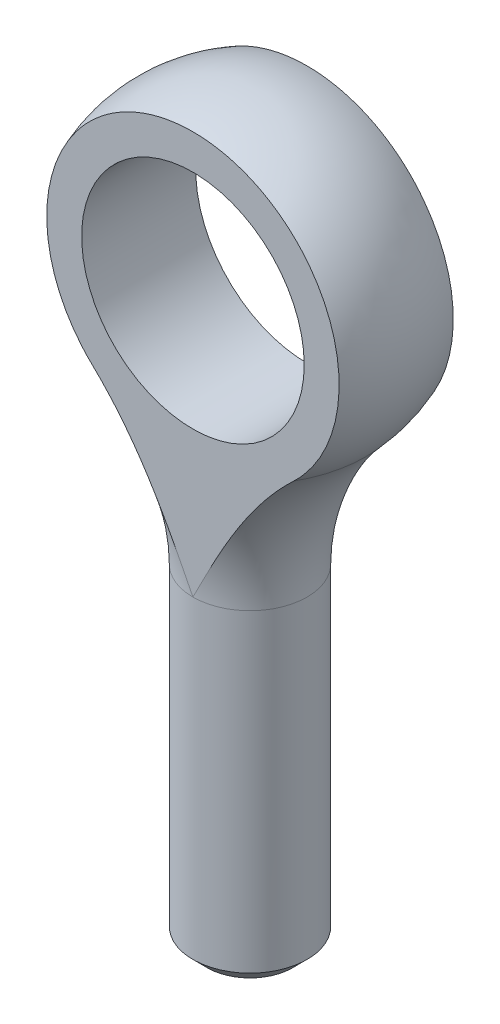
ISO-10303-21;
HEADER;
FILE_DESCRIPTION(('STEP AP214'),'2;1');
FILE_NAME('part.step','',(''),(''),'','','');
FILE_SCHEMA(('AUTOMOTIVE_DESIGN { 1 0 10303 214 1 1 1 1 }'));
ENDSEC;
DATA;
#1=APPLICATION_CONTEXT('core data for automotive mechanical design processes');
#2=APPLICATION_PROTOCOL_DEFINITION('international standard','automotive_design',2000,#1);
#3=PRODUCT_CONTEXT('',#1,'mechanical');
#4=PRODUCT('Part','Part','',(#3));
#5=PRODUCT_RELATED_PRODUCT_CATEGORY('part','',(#4));
#6=PRODUCT_DEFINITION_FORMATION('','',#4);
#7=PRODUCT_DEFINITION_CONTEXT('part definition',#1,'design');
#8=PRODUCT_DEFINITION('design','',#6,#7);
#9=PRODUCT_DEFINITION_SHAPE('','',#8);
#10=(LENGTH_UNIT() NAMED_UNIT(*) SI_UNIT(.MILLI.,.METRE.));
#11=(NAMED_UNIT(*) PLANE_ANGLE_UNIT() SI_UNIT($,.RADIAN.));
#12=(NAMED_UNIT(*) SI_UNIT($,.STERADIAN.) SOLID_ANGLE_UNIT());
#13=UNCERTAINTY_MEASURE_WITH_UNIT(LENGTH_MEASURE(1.E-05),#10,'distance_accuracy_value','');
#14=(GEOMETRIC_REPRESENTATION_CONTEXT(3) GLOBAL_UNCERTAINTY_ASSIGNED_CONTEXT((#13)) GLOBAL_UNIT_ASSIGNED_CONTEXT((#10,
#11,#12)) REPRESENTATION_CONTEXT('',''));
#15=CARTESIAN_POINT('',(0.,0.,0.));
#16=DIRECTION('',(0.,0.,1.));
#17=DIRECTION('',(1.,0.,0.));
#18=AXIS2_PLACEMENT_3D('',#15,#16,#17);
#19=CARTESIAN_POINT('',(0.,3.66738266034692,0.));
#20=DIRECTION('',(0.,-1.,0.));
#21=DIRECTION('',(1.,0.,0.));
#22=AXIS2_PLACEMENT_3D('',#19,#20,#21);
#23=TOROIDAL_SURFACE('',#22,15.5915178571429,12.4165178571429);
#24=CARTESIAN_POINT('',(0.,3.66738266034692,-3.17500000000003));
#25=CARTESIAN_POINT('',(-0.00237038639248425,3.67207024042008,-3.17500000000002));
#26=CARTESIAN_POINT('',(-0.0047407847306486,3.6767578276827,-3.17500000000001));
#27=CARTESIAN_POINT('',(-0.485043560300955,4.62657629955225,-3.17499999999795));
#28=CARTESIAN_POINT('',(-0.963633382985656,5.57190316622229,-3.17499999999962));
#29=CARTESIAN_POINT('',(-1.73462745998839,6.96134327814221,-3.17500000000019));
#30=CARTESIAN_POINT('',(-2.00056371956815,7.41986324573464,-3.17500000000005));
#31=CARTESIAN_POINT('',(-2.55710180648741,8.3218117391369,-3.17499999999995));
#32=CARTESIAN_POINT('',(-2.84770203353643,8.76524124146108,-3.17499999999999));
#33=CARTESIAN_POINT('',(-3.46476370189365,9.63924731103248,-3.17500000000001));
#34=CARTESIAN_POINT('',(-3.79179974259588,10.0694218125365,-3.175));
#35=CARTESIAN_POINT('',(-4.48078862300927,10.9012547955455,-3.175));
#36=CARTESIAN_POINT('',(-4.84274392638928,11.3029112615338,-3.175));
#37=CARTESIAN_POINT('',(-5.41232037598892,11.8782569571476,-3.175));
#38=CARTESIAN_POINT('',(-5.60647438355482,12.065394010299,-3.175));
#39=CARTESIAN_POINT('',(-6.00372022968159,12.4299407955579,-3.175));
#40=CARTESIAN_POINT('',(-6.20681150410909,12.6073511400465,-3.175));
#41=CARTESIAN_POINT('',(-6.62171255532744,12.9515397833133,-3.175));
#42=CARTESIAN_POINT('',(-6.83351952899958,13.1183214571462,-3.175));
#43=CARTESIAN_POINT('',(-7.26562639100238,13.4404979061972,-3.175));
#44=CARTESIAN_POINT('',(-7.48592653712525,13.5958923353637,-3.175));
#45=CARTESIAN_POINT('',(-8.03511064827244,13.9613640304038,-3.175));
#46=CARTESIAN_POINT('',(-8.36846361310571,14.1647876555393,-3.175));
#47=CARTESIAN_POINT('',(-9.05052809350383,14.5438311095355,-3.175));
#48=CARTESIAN_POINT('',(-9.39923639423919,14.7194567232105,-3.175));
#49=CARTESIAN_POINT('',(-10.1100567501134,15.0409404966869,-3.175));
#50=CARTESIAN_POINT('',(-10.4721659001931,15.1868050639982,-3.175));
#51=CARTESIAN_POINT('',(-11.2075532701077,15.4470753917616,-3.175));
#52=CARTESIAN_POINT('',(-11.5808319675569,15.561479804827,-3.175));
#53=CARTESIAN_POINT('',(-12.336490959587,15.7575152718324,-3.175));
#54=CARTESIAN_POINT('',(-12.718883520092,15.8390991684106,-3.175));
#55=CARTESIAN_POINT('',(-13.4893632399713,15.968117850843,-3.175));
#56=CARTESIAN_POINT('',(-13.8774500927971,16.015554468161,-3.175));
#57=CARTESIAN_POINT('',(-14.6577841451476,16.0755826720793,-3.175));
#58=CARTESIAN_POINT('',(-15.0500412794505,16.088048532247,-3.175));
#59=CARTESIAN_POINT('',(-15.6380145318431,16.0800075291072,-3.175));
#60=CARTESIAN_POINT('',(-15.8339939552744,16.0728645770856,-3.175));
#61=CARTESIAN_POINT('',(-16.2254283385916,16.0496404145281,-3.175));
#62=CARTESIAN_POINT('',(-16.4208832819348,16.0335589253148,-3.175));
#63=CARTESIAN_POINT('',(-16.6158955316021,16.0130008352036,-3.175));
#64=B_SPLINE_CURVE_WITH_KNOTS('',3,(#24,#25,#26,#27,#28,#29,#30,#31,#32,#33,#34,#35,#36,#37,#38,
#39,#40,#41,#42,#43,#44,#45,#46,#47,#48,#49,#50,#51,#52,#53,#54,#55,#56,#57,#58,#59,#60,#61,#62,
#63),.UNSPECIFIED.,.F.,.F.,(4,2,2,2,2,2,2,2,2,2,2,2,2,2,2,2,2,2,2,4),(0.,0.0157585011071128,
3.1930499013805,4.78263789641441,6.3721228317646,7.99168915439838,9.61136982644473,
10.4200773258596,11.2287338514893,12.0371323014763,12.8455553080312,14.0158003314805,
15.1858015038204,16.3555505101844,17.525349607176,18.6968235494079,19.8682346558314,
21.0438518407347,21.6320035038217,22.2201735047885),.UNSPECIFIED.);
#65=CARTESIAN_POINT('',(0.,3.66738266034688,-3.175));
#66=VERTEX_POINT('',#65);
#67=CARTESIAN_POINT('',(-5.5997808264663,12.0560220705346,-3.175));
#68=VERTEX_POINT('',#67);
#69=EDGE_CURVE('E62',#66,#68,#64,.T.);
#70=ORIENTED_EDGE('',*,*,#69,.F.);
#71=CARTESIAN_POINT('',(0.,3.66738266034688,0.));
#72=DIRECTION('',(0.,1.,0.));
#73=DIRECTION('',(-1.,0.,0.));
#74=AXIS2_PLACEMENT_3D('',#71,#72,#73);
#75=CIRCLE('',#74,3.175);
#76=CARTESIAN_POINT('',(0.,3.66738266034688,3.175));
#77=VERTEX_POINT('',#76);
#78=EDGE_CURVE('E90',#66,#77,#75,.T.);
#79=ORIENTED_EDGE('',*,*,#78,.T.);
#80=CARTESIAN_POINT('',(0.,3.66738266034692,3.17500000000003));
#81=CARTESIAN_POINT('',(-0.00237038639248425,3.67207024042008,3.17500000000002));
#82=CARTESIAN_POINT('',(-0.0047407847306486,3.6767578276827,3.17500000000001));
#83=CARTESIAN_POINT('',(-0.485043560300955,4.62657629955225,3.17499999999795));
#84=CARTESIAN_POINT('',(-0.963633382985656,5.57190316622229,3.17499999999962));
#85=CARTESIAN_POINT('',(-1.73462745998839,6.96134327814221,3.17500000000019));
#86=CARTESIAN_POINT('',(-2.00056371956815,7.41986324573464,3.17500000000005));
#87=CARTESIAN_POINT('',(-2.55710180648741,8.3218117391369,3.17499999999995));
#88=CARTESIAN_POINT('',(-2.84770203353643,8.76524124146108,3.17499999999999));
#89=CARTESIAN_POINT('',(-3.46476370189365,9.63924731103248,3.17500000000001));
#90=CARTESIAN_POINT('',(-3.79179974259588,10.0694218125365,3.175));
#91=CARTESIAN_POINT('',(-4.48078862300927,10.9012547955455,3.175));
#92=CARTESIAN_POINT('',(-4.84274392638928,11.3029112615338,3.175));
#93=CARTESIAN_POINT('',(-5.41232037598892,11.8782569571476,3.175));
#94=CARTESIAN_POINT('',(-5.60647438355482,12.065394010299,3.175));
#95=CARTESIAN_POINT('',(-6.00372022968159,12.4299407955579,3.175));
#96=CARTESIAN_POINT('',(-6.20681150410909,12.6073511400465,3.175));
#97=CARTESIAN_POINT('',(-6.62171255532744,12.9515397833133,3.175));
#98=CARTESIAN_POINT('',(-6.83351952899958,13.1183214571462,3.175));
#99=CARTESIAN_POINT('',(-7.26562639100238,13.4404979061972,3.175));
#100=CARTESIAN_POINT('',(-7.48592653712525,13.5958923353637,3.175));
#101=CARTESIAN_POINT('',(-8.03511064827244,13.9613640304038,3.175));
#102=CARTESIAN_POINT('',(-8.36846361310571,14.1647876555393,3.175));
#103=CARTESIAN_POINT('',(-9.05052809350383,14.5438311095355,3.175));
#104=CARTESIAN_POINT('',(-9.39923639423919,14.7194567232105,3.175));
#105=CARTESIAN_POINT('',(-10.1100567501134,15.0409404966869,3.175));
#106=CARTESIAN_POINT('',(-10.4721659001931,15.1868050639982,3.175));
#107=CARTESIAN_POINT('',(-11.2075532701077,15.4470753917616,3.175));
#108=CARTESIAN_POINT('',(-11.5808319675569,15.561479804827,3.175));
#109=CARTESIAN_POINT('',(-12.336490959587,15.7575152718324,3.175));
#110=CARTESIAN_POINT('',(-12.718883520092,15.8390991684106,3.175));
#111=CARTESIAN_POINT('',(-13.4893632399713,15.968117850843,3.175));
#112=CARTESIAN_POINT('',(-13.8774500927971,16.015554468161,3.175));
#113=CARTESIAN_POINT('',(-14.6577841451476,16.0755826720793,3.175));
#114=CARTESIAN_POINT('',(-15.0500412794505,16.088048532247,3.175));
#115=CARTESIAN_POINT('',(-15.6380145318431,16.0800075291072,3.175));
#116=CARTESIAN_POINT('',(-15.8339939552744,16.0728645770856,3.175));
#117=CARTESIAN_POINT('',(-16.2254283385916,16.0496404145281,3.175));
#118=CARTESIAN_POINT('',(-16.4208832819348,16.0335589253148,3.175));
#119=CARTESIAN_POINT('',(-16.6158955316021,16.0130008352036,3.175));
#120=B_SPLINE_CURVE_WITH_KNOTS('',3,(#80,#81,#82,#83,#84,#85,#86,#87,#88,#89,#90,#91,#92,#93,
#94,#95,#96,#97,#98,#99,#100,#101,#102,#103,#104,#105,#106,#107,#108,#109,#110,#111,#112,#113,
#114,#115,#116,#117,#118,#119),.UNSPECIFIED.,.F.,.F.,(4,2,2,2,2,2,2,2,2,2,2,2,2,2,2,2,2,2,2,4),
(0.,0.0157585011071128,3.1930499013805,4.78263789641441,6.3721228317646,7.99168915439838,
9.61136982644473,10.4200773258596,11.2287338514893,12.0371323014763,12.8455553080312,
14.0158003314805,15.1858015038204,16.3555505101844,17.525349607176,18.6968235494079,
19.8682346558314,21.0438518407347,21.6320035038217,22.2201735047885),.UNSPECIFIED.);
#121=CARTESIAN_POINT('',(-5.5997808264663,12.0560220705346,3.175));
#122=VERTEX_POINT('',#121);
#123=EDGE_CURVE('E94',#122,#77,#120,.F.);
#124=ORIENTED_EDGE('',*,*,#123,.F.);
#125=CARTESIAN_POINT('',(0.,12.0560220705346,0.));
#126=DIRECTION('',(0.,-1.,0.));
#127=DIRECTION('',(1.,0.,0.));
#128=AXIS2_PLACEMENT_3D('',#125,#126,#127);
#129=CIRCLE('',#128,6.43724865951746);
#130=EDGE_CURVE('E93',#122,#68,#129,.T.);
#131=ORIENTED_EDGE('',*,*,#130,.T.);
#132=EDGE_LOOP('',(#70,#79,#124,#131));
#133=FACE_BOUND('',#132,.T.);
#134=ADVANCED_FACE('F48',(#133),#23,.F.);
#135=CARTESIAN_POINT('',(0.,-14.5888673396531,0.));
#136=DIRECTION('',(0.,1.,0.));
#137=DIRECTION('',(-1.,0.,0.));
#138=AXIS2_PLACEMENT_3D('',#135,#136,#137);
#139=PLANE('',#138);
#140=CARTESIAN_POINT('',(0.,-14.5888673396531,0.));
#141=DIRECTION('',(0.,1.,0.));
#142=DIRECTION('',(-1.,0.,0.));
#143=AXIS2_PLACEMENT_3D('',#140,#141,#142);
#144=CIRCLE('',#143,2.38125);
#145=CARTESIAN_POINT('',(-2.38125000000001,-14.5888673396531,0.));
#146=VERTEX_POINT('',#145);
#147=EDGE_CURVE('E105',#146,#146,#144,.F.);
#148=ORIENTED_EDGE('',*,*,#147,.T.);
#149=EDGE_LOOP('',(#148));
#150=FACE_BOUND('',#149,.T.);
#151=ADVANCED_FACE('F140',(#150),#139,.F.);
#152=CARTESIAN_POINT('',(0.,26.6861326603469,0.));
#153=DIRECTION('',(0.,1.,0.));
#154=DIRECTION('',(-1.,0.,0.));
#155=AXIS2_PLACEMENT_3D('',#152,#153,#154);
#156=CYLINDRICAL_SURFACE('',#155,3.175);
#157=CARTESIAN_POINT('',(0.,-13.7951173396531,0.));
#158=DIRECTION('',(0.,1.,0.));
#159=DIRECTION('',(-1.,0.,0.));
#160=AXIS2_PLACEMENT_3D('',#157,#158,#159);
#161=CIRCLE('',#160,3.175);
#162=CARTESIAN_POINT('',(-3.17500000000001,-13.7951173396531,0.));
#163=VERTEX_POINT('',#162);
#164=EDGE_CURVE('E103',#163,#163,#161,.T.);
#165=ORIENTED_EDGE('',*,*,#164,.T.);
#166=EDGE_LOOP('',(#165));
#167=FACE_BOUND('',#166,.T.);
#168=EDGE_CURVE('E99',#77,#66,#75,.T.);
#169=ORIENTED_EDGE('',*,*,#168,.F.);
#170=ORIENTED_EDGE('',*,*,#78,.F.);
#171=EDGE_LOOP('',(#169,#170));
#172=FACE_BOUND('',#171,.T.);
#173=ADVANCED_FACE('F98',(#167,#172),#156,.T.);
#174=CARTESIAN_POINT('',(0.,-13.7951173396531,0.));
#175=DIRECTION('',(0.,1.,0.));
#176=DIRECTION('',(-1.,0.,0.));
#177=AXIS2_PLACEMENT_3D('',#174,#175,#176);
#178=CONICAL_SURFACE('',#177,3.175,0.785398163397451);
#179=ORIENTED_EDGE('',*,*,#147,.F.);
#180=EDGE_LOOP('',(#179));
#181=FACE_BOUND('',#180,.T.);
#182=ORIENTED_EDGE('',*,*,#164,.F.);
#183=EDGE_LOOP('',(#182));
#184=FACE_BOUND('',#183,.T.);
#185=ADVANCED_FACE('F50',(#181,#184),#178,.T.);
#186=CARTESIAN_POINT('',(0.,3.66738266034692,-3.17500000000003));
#187=CARTESIAN_POINT('',(0.00237038639235185,3.67207024042008,-3.17500000000002));
#188=CARTESIAN_POINT('',(0.00474078473051622,3.6767578276827,-3.17500000000001));
#189=CARTESIAN_POINT('',(0.485043560300827,4.62657629955224,-3.17499999999795));
#190=CARTESIAN_POINT('',(0.963633382985535,5.57190316622229,-3.17499999999962));
#191=CARTESIAN_POINT('',(1.73462745998828,6.9613432781422,-3.17500000000019));
#192=CARTESIAN_POINT('',(2.00056371956803,7.41986324573463,-3.17500000000005));
#193=CARTESIAN_POINT('',(2.5571018064873,8.32181173913689,-3.17499999999995));
#194=CARTESIAN_POINT('',(2.84770203353633,8.76524124146106,-3.17499999999999));
#195=CARTESIAN_POINT('',(3.46476370189354,9.63924731103246,-3.17500000000001));
#196=CARTESIAN_POINT('',(3.79179974259578,10.0694218125365,-3.175));
#197=CARTESIAN_POINT('',(4.48078862300918,10.9012547955455,-3.175));
#198=CARTESIAN_POINT('',(4.84274392638918,11.3029112615338,-3.175));
#199=CARTESIAN_POINT('',(5.41232037598883,11.8782569571476,-3.175));
#200=CARTESIAN_POINT('',(5.60647438355473,12.0653940102989,-3.175));
#201=CARTESIAN_POINT('',(6.0037202296815,12.4299407955579,-3.175));
#202=CARTESIAN_POINT('',(6.20681150410901,12.6073511400465,-3.175));
#203=CARTESIAN_POINT('',(6.62171255532735,12.9515397833133,-3.175));
#204=CARTESIAN_POINT('',(6.8335195289995,13.1183214571462,-3.175));
#205=CARTESIAN_POINT('',(7.26562639100229,13.4404979061972,-3.175));
#206=CARTESIAN_POINT('',(7.48592653712517,13.5958923353637,-3.175));
#207=CARTESIAN_POINT('',(8.03511064827235,13.9613640304037,-3.175));
#208=CARTESIAN_POINT('',(8.36846361310563,14.1647876555393,-3.175));
#209=CARTESIAN_POINT('',(9.05052809350375,14.5438311095355,-3.175));
#210=CARTESIAN_POINT('',(9.39923639423911,14.7194567232104,-3.175));
#211=CARTESIAN_POINT('',(10.1100567501133,15.0409404966868,-3.175));
#212=CARTESIAN_POINT('',(10.472165900193,15.1868050639981,-3.175));
#213=CARTESIAN_POINT('',(11.2075532701076,15.4470753917615,-3.175));
#214=CARTESIAN_POINT('',(11.5808319675568,15.5614798048269,-3.175));
#215=CARTESIAN_POINT('',(12.3364909595869,15.7575152718324,-3.175));
#216=CARTESIAN_POINT('',(12.718883520092,15.8390991684105,-3.175));
#217=CARTESIAN_POINT('',(13.4893632399713,15.968117850843,-3.175));
#218=CARTESIAN_POINT('',(13.877450092797,16.0155544681609,-3.175));
#219=CARTESIAN_POINT('',(14.6577841451475,16.0755826720793,-3.175));
#220=CARTESIAN_POINT('',(15.0500412794504,16.0880485322469,-3.175));
#221=CARTESIAN_POINT('',(15.638014531843,16.0800075291072,-3.175));
#222=CARTESIAN_POINT('',(15.8339939552743,16.0728645770855,-3.175));
#223=CARTESIAN_POINT('',(16.2254283385915,16.049640414528,-3.175));
#224=CARTESIAN_POINT('',(16.4208832819347,16.0335589253147,-3.175));
#225=CARTESIAN_POINT('',(16.615895531602,16.0130008352036,-3.175));
#226=B_SPLINE_CURVE_WITH_KNOTS('',3,(#186,#187,#188,#189,#190,#191,#192,#193,#194,#195,#196,
#197,#198,#199,#200,#201,#202,#203,#204,#205,#206,#207,#208,#209,#210,#211,#212,#213,#214,#215,
#216,#217,#218,#219,#220,#221,#222,#223,#224,#225),.UNSPECIFIED.,.F.,.F.,(4,2,2,2,2,2,2,2,2,2,2,
2,2,2,2,2,2,2,2,4),(0.,0.0157585011071128,3.1930499013805,4.78263789641441,6.3721228317646,
7.99168915439838,9.61136982644473,10.4200773258596,11.2287338514893,12.0371323014763,
12.8455553080312,14.0158003314805,15.1858015038204,16.3555505101844,17.525349607176,
18.6968235494079,19.8682346558314,21.0438518407347,21.6320035038217,22.2201735047885),.UNSPECIFIED.);
#227=CARTESIAN_POINT('',(5.59978082646623,12.0560220705346,-3.175));
#228=VERTEX_POINT('',#227);
#229=EDGE_CURVE('E81',#228,#66,#226,.F.);
#230=ORIENTED_EDGE('',*,*,#229,.F.);
#231=CARTESIAN_POINT('',(5.59978082646623,12.0560220705346,3.175));
#232=VERTEX_POINT('',#231);
#233=EDGE_CURVE('E70',#228,#232,#129,.T.);
#234=ORIENTED_EDGE('',*,*,#233,.T.);
#235=CARTESIAN_POINT('',(0.,3.66738266034692,3.17500000000003));
#236=CARTESIAN_POINT('',(0.00237038639235185,3.67207024042008,3.17500000000002));
#237=CARTESIAN_POINT('',(0.00474078473051622,3.6767578276827,3.17500000000001));
#238=CARTESIAN_POINT('',(0.485043560300827,4.62657629955224,3.17499999999795));
#239=CARTESIAN_POINT('',(0.963633382985535,5.57190316622229,3.17499999999962));
#240=CARTESIAN_POINT('',(1.73462745998828,6.9613432781422,3.17500000000019));
#241=CARTESIAN_POINT('',(2.00056371956803,7.41986324573463,3.17500000000005));
#242=CARTESIAN_POINT('',(2.5571018064873,8.32181173913689,3.17499999999995));
#243=CARTESIAN_POINT('',(2.84770203353633,8.76524124146106,3.17499999999999));
#244=CARTESIAN_POINT('',(3.46476370189354,9.63924731103246,3.17500000000001));
#245=CARTESIAN_POINT('',(3.79179974259578,10.0694218125365,3.175));
#246=CARTESIAN_POINT('',(4.48078862300918,10.9012547955455,3.175));
#247=CARTESIAN_POINT('',(4.84274392638918,11.3029112615338,3.175));
#248=CARTESIAN_POINT('',(5.41232037598883,11.8782569571476,3.175));
#249=CARTESIAN_POINT('',(5.60647438355473,12.0653940102989,3.175));
#250=CARTESIAN_POINT('',(6.0037202296815,12.4299407955579,3.175));
#251=CARTESIAN_POINT('',(6.20681150410901,12.6073511400465,3.175));
#252=CARTESIAN_POINT('',(6.62171255532735,12.9515397833133,3.175));
#253=CARTESIAN_POINT('',(6.8335195289995,13.1183214571462,3.175));
#254=CARTESIAN_POINT('',(7.26562639100229,13.4404979061972,3.175));
#255=CARTESIAN_POINT('',(7.48592653712517,13.5958923353637,3.175));
#256=CARTESIAN_POINT('',(8.03511064827235,13.9613640304037,3.175));
#257=CARTESIAN_POINT('',(8.36846361310563,14.1647876555393,3.175));
#258=CARTESIAN_POINT('',(9.05052809350375,14.5438311095355,3.175));
#259=CARTESIAN_POINT('',(9.39923639423911,14.7194567232104,3.175));
#260=CARTESIAN_POINT('',(10.1100567501133,15.0409404966868,3.175));
#261=CARTESIAN_POINT('',(10.472165900193,15.1868050639981,3.175));
#262=CARTESIAN_POINT('',(11.2075532701076,15.4470753917615,3.175));
#263=CARTESIAN_POINT('',(11.5808319675568,15.5614798048269,3.175));
#264=CARTESIAN_POINT('',(12.3364909595869,15.7575152718324,3.175));
#265=CARTESIAN_POINT('',(12.718883520092,15.8390991684105,3.175));
#266=CARTESIAN_POINT('',(13.4893632399713,15.968117850843,3.175));
#267=CARTESIAN_POINT('',(13.877450092797,16.0155544681609,3.175));
#268=CARTESIAN_POINT('',(14.6577841451475,16.0755826720793,3.175));
#269=CARTESIAN_POINT('',(15.0500412794504,16.0880485322469,3.175));
#270=CARTESIAN_POINT('',(15.638014531843,16.0800075291072,3.175));
#271=CARTESIAN_POINT('',(15.8339939552743,16.0728645770855,3.175));
#272=CARTESIAN_POINT('',(16.2254283385915,16.049640414528,3.175));
#273=CARTESIAN_POINT('',(16.4208832819347,16.0335589253147,3.175));
#274=CARTESIAN_POINT('',(16.615895531602,16.0130008352036,3.175));
#275=B_SPLINE_CURVE_WITH_KNOTS('',3,(#235,#236,#237,#238,#239,#240,#241,#242,#243,#244,#245,
#246,#247,#248,#249,#250,#251,#252,#253,#254,#255,#256,#257,#258,#259,#260,#261,#262,#263,#264,
#265,#266,#267,#268,#269,#270,#271,#272,#273,#274),.UNSPECIFIED.,.F.,.F.,(4,2,2,2,2,2,2,2,2,2,2,
2,2,2,2,2,2,2,2,4),(0.,0.0157585011071128,3.1930499013805,4.78263789641441,6.3721228317646,
7.99168915439838,9.61136982644473,10.4200773258596,11.2287338514893,12.0371323014763,
12.8455553080312,14.0158003314805,15.1858015038204,16.3555505101844,17.525349607176,
18.6968235494079,19.8682346558314,21.0438518407347,21.6320035038217,22.2201735047885),.UNSPECIFIED.);
#276=EDGE_CURVE('E102',#77,#232,#275,.T.);
#277=ORIENTED_EDGE('',*,*,#276,.F.);
#278=ORIENTED_EDGE('',*,*,#168,.T.);
#279=EDGE_LOOP('',(#230,#234,#277,#278));
#280=FACE_BOUND('',#279,.T.);
#281=ADVANCED_FACE('F101',(#280),#23,.F.);
#282=CARTESIAN_POINT('',(0.,17.9548826603469,0.));
#283=DIRECTION('',(0.,-1.,0.));
#284=DIRECTION('',(1.,0.,0.));
#285=AXIS2_PLACEMENT_3D('',#282,#283,#284);
#286=SPHERICAL_SURFACE('',#285,8.73125);
#287=CARTESIAN_POINT('',(0.,17.9548826603469,-3.175));
#288=DIRECTION('',(0.,0.,1.));
#289=DIRECTION('',(0.,-1.,0.));
#290=AXIS2_PLACEMENT_3D('',#287,#288,#289);
#291=CIRCLE('',#290,8.13351717048043);
#292=EDGE_CURVE('E13',#68,#228,#291,.F.);
#293=ORIENTED_EDGE('',*,*,#292,.F.);
#294=ORIENTED_EDGE('',*,*,#130,.F.);
#295=CARTESIAN_POINT('',(0.,17.9548826603469,3.175));
#296=DIRECTION('',(0.,0.,-1.));
#297=DIRECTION('',(0.,1.,0.));
#298=AXIS2_PLACEMENT_3D('',#295,#296,#297);
#299=CIRCLE('',#298,8.13351717048043);
#300=EDGE_CURVE('E56',#232,#122,#299,.F.);
#301=ORIENTED_EDGE('',*,*,#300,.F.);
#302=ORIENTED_EDGE('',*,*,#233,.F.);
#303=EDGE_LOOP('',(#293,#294,#301,#302));
#304=FACE_BOUND('',#303,.T.);
#305=ADVANCED_FACE('F116',(#304),#286,.T.);
#306=CARTESIAN_POINT('',(-8.73125000000001,26.6861326603469,3.175));
#307=DIRECTION('',(0.,0.,-1.));
#308=DIRECTION('',(0.,1.,0.));
#309=AXIS2_PLACEMENT_3D('',#306,#307,#308);
#310=PLANE('',#309);
#311=CARTESIAN_POINT('',(0.,17.9548826603469,3.175));
#312=DIRECTION('',(0.,0.,1.));
#313=DIRECTION('',(1.,0.,0.));
#314=AXIS2_PLACEMENT_3D('',#311,#312,#313);
#315=CIRCLE('',#314,6.19125);
#316=CARTESIAN_POINT('',(6.19124999999999,17.9548826603469,3.175));
#317=VERTEX_POINT('',#316);
#318=EDGE_CURVE('E199',#317,#317,#315,.T.);
#319=ORIENTED_EDGE('',*,*,#318,.F.);
#320=EDGE_LOOP('',(#319));
#321=FACE_BOUND('',#320,.T.);
#322=ORIENTED_EDGE('',*,*,#276,.T.);
#323=ORIENTED_EDGE('',*,*,#300,.T.);
#324=ORIENTED_EDGE('',*,*,#123,.T.);
#325=EDGE_LOOP('',(#322,#323,#324));
#326=FACE_BOUND('',#325,.T.);
#327=ADVANCED_FACE('F113',(#321,#326),#310,.F.);
#328=CARTESIAN_POINT('',(-8.73125000000001,26.6861326603469,-3.175));
#329=DIRECTION('',(0.,0.,1.));
#330=DIRECTION('',(0.,-1.,0.));
#331=AXIS2_PLACEMENT_3D('',#328,#329,#330);
#332=PLANE('',#331);
#333=CARTESIAN_POINT('',(0.,17.9548826603469,-3.175));
#334=DIRECTION('',(0.,0.,1.));
#335=DIRECTION('',(1.,0.,0.));
#336=AXIS2_PLACEMENT_3D('',#333,#334,#335);
#337=CIRCLE('',#336,6.19125);
#338=CARTESIAN_POINT('',(6.19124999999999,17.9548826603469,-3.175));
#339=VERTEX_POINT('',#338);
#340=EDGE_CURVE('E84',#339,#339,#337,.T.);
#341=ORIENTED_EDGE('',*,*,#340,.T.);
#342=EDGE_LOOP('',(#341));
#343=FACE_BOUND('',#342,.T.);
#344=ORIENTED_EDGE('',*,*,#69,.T.);
#345=ORIENTED_EDGE('',*,*,#292,.T.);
#346=ORIENTED_EDGE('',*,*,#229,.T.);
#347=EDGE_LOOP('',(#344,#345,#346));
#348=FACE_BOUND('',#347,.T.);
#349=ADVANCED_FACE('F82',(#343,#348),#332,.F.);
#350=CARTESIAN_POINT('',(0.,17.9548826603469,-3.175));
#351=DIRECTION('',(0.,0.,1.));
#352=DIRECTION('',(1.,0.,0.));
#353=AXIS2_PLACEMENT_3D('',#350,#351,#352);
#354=CYLINDRICAL_SURFACE('',#353,6.19125);
#355=ORIENTED_EDGE('',*,*,#340,.F.);
#356=EDGE_LOOP('',(#355));
#357=FACE_BOUND('',#356,.T.);
#358=ORIENTED_EDGE('',*,*,#318,.T.);
#359=EDGE_LOOP('',(#358));
#360=FACE_BOUND('',#359,.T.);
#361=ADVANCED_FACE('F182',(#357,#360),#354,.F.);
#362=CLOSED_SHELL('',(#134,#151,#173,#185,#281,#305,#327,#349,#361));
#363=MANIFOLD_SOLID_BREP('B2',#362);
#364=ADVANCED_BREP_SHAPE_REPRESENTATION('',(#18,#363),#14);
#365=SHAPE_DEFINITION_REPRESENTATION(#9,#364);
ENDSEC;
END-ISO-10303-21;
